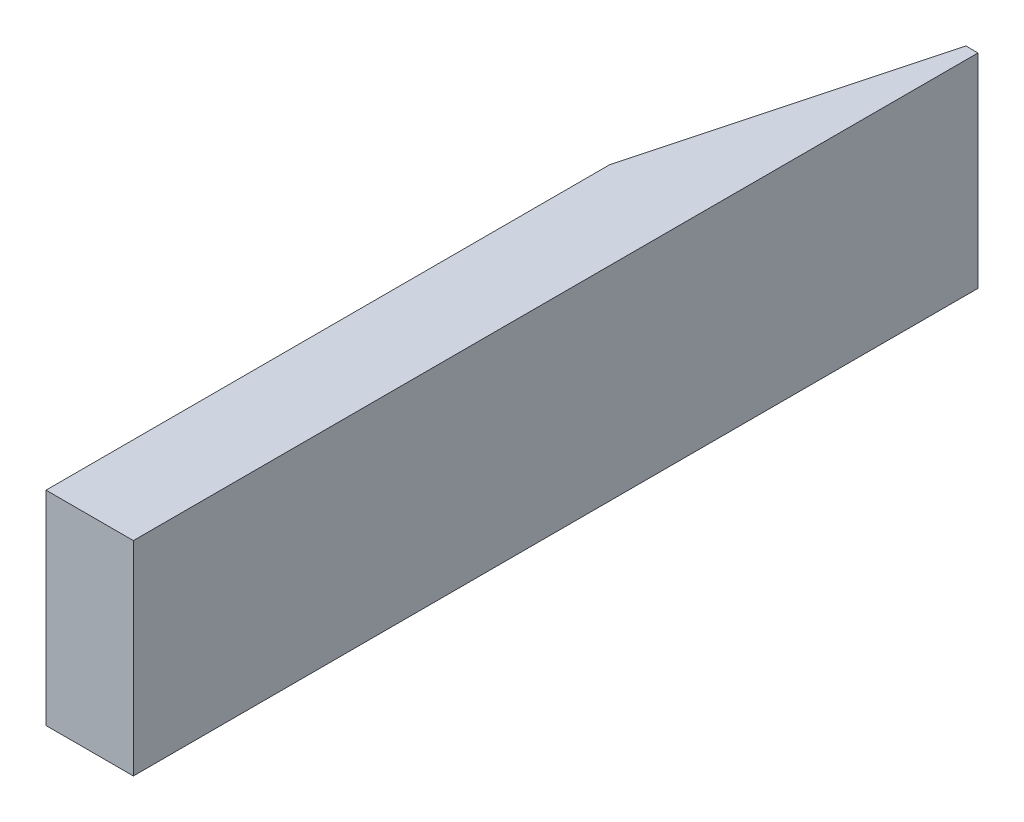
ISO-10303-21;
HEADER;
FILE_DESCRIPTION(('STEP AP214'),'2;1');
FILE_NAME('part.step','',(''),(''),'','','');
FILE_SCHEMA(('AUTOMOTIVE_DESIGN { 1 0 10303 214 1 1 1 1 }'));
ENDSEC;
DATA;
#1=APPLICATION_CONTEXT('core data for automotive mechanical design processes');
#2=APPLICATION_PROTOCOL_DEFINITION('international standard','automotive_design',2000,#1);
#3=PRODUCT_CONTEXT('',#1,'mechanical');
#4=PRODUCT('Part','Part','',(#3));
#5=PRODUCT_RELATED_PRODUCT_CATEGORY('part','',(#4));
#6=PRODUCT_DEFINITION_FORMATION('','',#4);
#7=PRODUCT_DEFINITION_CONTEXT('part definition',#1,'design');
#8=PRODUCT_DEFINITION('design','',#6,#7);
#9=PRODUCT_DEFINITION_SHAPE('','',#8);
#10=(LENGTH_UNIT() NAMED_UNIT(*) SI_UNIT(.MILLI.,.METRE.));
#11=(NAMED_UNIT(*) PLANE_ANGLE_UNIT() SI_UNIT($,.RADIAN.));
#12=(NAMED_UNIT(*) SI_UNIT($,.STERADIAN.) SOLID_ANGLE_UNIT());
#13=UNCERTAINTY_MEASURE_WITH_UNIT(LENGTH_MEASURE(1.E-05),#10,'distance_accuracy_value','');
#14=(GEOMETRIC_REPRESENTATION_CONTEXT(3) GLOBAL_UNCERTAINTY_ASSIGNED_CONTEXT((#13)) GLOBAL_UNIT_ASSIGNED_CONTEXT((#10,
#11,#12)) REPRESENTATION_CONTEXT('',''));
#15=CARTESIAN_POINT('',(0.,0.,0.));
#16=DIRECTION('',(0.,0.,1.));
#17=DIRECTION('',(1.,0.,0.));
#18=AXIS2_PLACEMENT_3D('',#15,#16,#17);
#19=CARTESIAN_POINT('',(0.,0.,368.3));
#20=DIRECTION('',(1.,0.,0.));
#21=DIRECTION('',(0.,1.,0.));
#22=AXIS2_PLACEMENT_3D('',#19,#20,#21);
#23=PLANE('',#22);
#24=DIRECTION('',(0.,0.,-1.));
#25=VECTOR('',#24,1.);
#26=CARTESIAN_POINT('',(0.,88.9,368.3));
#27=LINE('',#26,#25);
#28=CARTESIAN_POINT('',(0.,88.9,368.3));
#29=VERTEX_POINT('',#28);
#30=CARTESIAN_POINT('',(0.,88.9,122.635189536713));
#31=VERTEX_POINT('',#30);
#32=EDGE_CURVE('E108',#29,#31,#27,.T.);
#33=ORIENTED_EDGE('',*,*,#32,.T.);
#34=DIRECTION('',(0.,-1.,0.));
#35=VECTOR('',#34,1.);
#36=CARTESIAN_POINT('',(0.,0.,122.635189536713));
#37=LINE('',#36,#35);
#38=CARTESIAN_POINT('',(0.,0.,122.635189536713));
#39=VERTEX_POINT('',#38);
#40=EDGE_CURVE('E99',#31,#39,#37,.T.);
#41=ORIENTED_EDGE('',*,*,#40,.T.);
#42=DIRECTION('',(0.,0.,-1.));
#43=VECTOR('',#42,1.);
#44=CARTESIAN_POINT('',(0.,0.,368.3));
#45=LINE('',#44,#43);
#46=CARTESIAN_POINT('',(0.,0.,368.3));
#47=VERTEX_POINT('',#46);
#48=EDGE_CURVE('E80',#47,#39,#45,.T.);
#49=ORIENTED_EDGE('',*,*,#48,.F.);
#50=DIRECTION('',(0.,-1.,0.));
#51=VECTOR('',#50,1.);
#52=CARTESIAN_POINT('',(0.,0.,368.3));
#53=LINE('',#52,#51);
#54=EDGE_CURVE('E86',#29,#47,#53,.T.);
#55=ORIENTED_EDGE('',*,*,#54,.F.);
#56=EDGE_LOOP('',(#33,#41,#49,#55));
#57=FACE_BOUND('',#56,.T.);
#58=ADVANCED_FACE('F32',(#57),#23,.F.);
#59=CARTESIAN_POINT('',(0.,0.,368.3));
#60=DIRECTION('',(0.,1.,0.));
#61=DIRECTION('',(0.,0.,1.));
#62=AXIS2_PLACEMENT_3D('',#59,#60,#61);
#63=PLANE('',#62);
#64=ORIENTED_EDGE('',*,*,#48,.T.);
#65=DIRECTION('',(0.258819045102521,0.,-0.965925826289068));
#66=VECTOR('',#65,1.);
#67=CARTESIAN_POINT('',(0.,0.,122.635189536713));
#68=LINE('',#67,#66);
#69=CARTESIAN_POINT('',(32.86,0.,0.));
#70=VERTEX_POINT('',#69);
#71=EDGE_CURVE('E54',#39,#70,#68,.T.);
#72=ORIENTED_EDGE('',*,*,#71,.T.);
#73=DIRECTION('',(1.,0.,0.));
#74=VECTOR('',#73,1.);
#75=CARTESIAN_POINT('',(0.,0.,0.));
#76=LINE('',#75,#74);
#77=CARTESIAN_POINT('',(38.1,0.,0.));
#78=VERTEX_POINT('',#77);
#79=EDGE_CURVE('E113',#70,#78,#76,.T.);
#80=ORIENTED_EDGE('',*,*,#79,.T.);
#81=DIRECTION('',(0.,0.,-1.));
#82=VECTOR('',#81,1.);
#83=CARTESIAN_POINT('',(38.1,0.,368.3));
#84=LINE('',#83,#82);
#85=CARTESIAN_POINT('',(38.1,0.,368.3));
#86=VERTEX_POINT('',#85);
#87=EDGE_CURVE('E82',#86,#78,#84,.T.);
#88=ORIENTED_EDGE('',*,*,#87,.F.);
#89=DIRECTION('',(1.,0.,0.));
#90=VECTOR('',#89,1.);
#91=CARTESIAN_POINT('',(0.,0.,368.3));
#92=LINE('',#91,#90);
#93=EDGE_CURVE('E76',#47,#86,#92,.T.);
#94=ORIENTED_EDGE('',*,*,#93,.F.);
#95=EDGE_LOOP('',(#64,#72,#80,#88,#94));
#96=FACE_BOUND('',#95,.T.);
#97=ADVANCED_FACE('F78',(#96),#63,.F.);
#98=CARTESIAN_POINT('',(38.1,0.,368.3));
#99=DIRECTION('',(-1.,0.,0.));
#100=DIRECTION('',(0.,-1.,0.));
#101=AXIS2_PLACEMENT_3D('',#98,#99,#100);
#102=PLANE('',#101);
#103=DIRECTION('',(0.,1.,0.));
#104=VECTOR('',#103,1.);
#105=CARTESIAN_POINT('',(38.1,0.,0.));
#106=LINE('',#105,#104);
#107=CARTESIAN_POINT('',(38.1,88.9,0.));
#108=VERTEX_POINT('',#107);
#109=EDGE_CURVE('E111',#78,#108,#106,.T.);
#110=ORIENTED_EDGE('',*,*,#109,.T.);
#111=DIRECTION('',(0.,0.,-1.));
#112=VECTOR('',#111,1.);
#113=CARTESIAN_POINT('',(38.1,88.9,368.3));
#114=LINE('',#113,#112);
#115=CARTESIAN_POINT('',(38.1,88.9,368.3));
#116=VERTEX_POINT('',#115);
#117=EDGE_CURVE('E102',#116,#108,#114,.T.);
#118=ORIENTED_EDGE('',*,*,#117,.F.);
#119=DIRECTION('',(0.,1.,0.));
#120=VECTOR('',#119,1.);
#121=CARTESIAN_POINT('',(38.1,0.,368.3));
#122=LINE('',#121,#120);
#123=EDGE_CURVE('E85',#86,#116,#122,.T.);
#124=ORIENTED_EDGE('',*,*,#123,.F.);
#125=ORIENTED_EDGE('',*,*,#87,.T.);
#126=EDGE_LOOP('',(#110,#118,#124,#125));
#127=FACE_BOUND('',#126,.T.);
#128=ADVANCED_FACE('F118',(#127),#102,.F.);
#129=CARTESIAN_POINT('',(0.,88.9,368.3));
#130=DIRECTION('',(0.,-1.,0.));
#131=DIRECTION('',(0.,0.,-1.));
#132=AXIS2_PLACEMENT_3D('',#129,#130,#131);
#133=PLANE('',#132);
#134=DIRECTION('',(-1.,0.,0.));
#135=VECTOR('',#134,1.);
#136=CARTESIAN_POINT('',(0.,88.9,0.));
#137=LINE('',#136,#135);
#138=CARTESIAN_POINT('',(32.86,88.9,0.));
#139=VERTEX_POINT('',#138);
#140=EDGE_CURVE('E95',#108,#139,#137,.T.);
#141=ORIENTED_EDGE('',*,*,#140,.T.);
#142=DIRECTION('',(-0.258819045102521,0.,0.965925826289068));
#143=VECTOR('',#142,1.);
#144=CARTESIAN_POINT('',(0.,88.9,122.635189536713));
#145=LINE('',#144,#143);
#146=EDGE_CURVE('E11',#139,#31,#145,.T.);
#147=ORIENTED_EDGE('',*,*,#146,.T.);
#148=ORIENTED_EDGE('',*,*,#32,.F.);
#149=DIRECTION('',(-1.,0.,0.));
#150=VECTOR('',#149,1.);
#151=CARTESIAN_POINT('',(0.,88.9,368.3));
#152=LINE('',#151,#150);
#153=EDGE_CURVE('E91',#116,#29,#152,.T.);
#154=ORIENTED_EDGE('',*,*,#153,.F.);
#155=ORIENTED_EDGE('',*,*,#117,.T.);
#156=EDGE_LOOP('',(#141,#147,#148,#154,#155));
#157=FACE_BOUND('',#156,.T.);
#158=ADVANCED_FACE('F121',(#157),#133,.F.);
#159=CARTESIAN_POINT('',(0.,0.,368.3));
#160=DIRECTION('',(0.,0.,-1.));
#161=DIRECTION('',(-1.,0.,0.));
#162=AXIS2_PLACEMENT_3D('',#159,#160,#161);
#163=PLANE('',#162);
#164=ORIENTED_EDGE('',*,*,#54,.T.);
#165=ORIENTED_EDGE('',*,*,#93,.T.);
#166=ORIENTED_EDGE('',*,*,#123,.T.);
#167=ORIENTED_EDGE('',*,*,#153,.T.);
#168=EDGE_LOOP('',(#164,#165,#166,#167));
#169=FACE_BOUND('',#168,.T.);
#170=ADVANCED_FACE('F89',(#169),#163,.F.);
#171=CARTESIAN_POINT('',(0.,0.,0.));
#172=DIRECTION('',(0.,0.,-1.));
#173=DIRECTION('',(-1.,0.,0.));
#174=AXIS2_PLACEMENT_3D('',#171,#172,#173);
#175=PLANE('',#174);
#176=ORIENTED_EDGE('',*,*,#79,.F.);
#177=DIRECTION('',(0.,1.,0.));
#178=VECTOR('',#177,1.);
#179=CARTESIAN_POINT('',(32.86,88.9,0.));
#180=LINE('',#179,#178);
#181=EDGE_CURVE('E40',#70,#139,#180,.T.);
#182=ORIENTED_EDGE('',*,*,#181,.T.);
#183=ORIENTED_EDGE('',*,*,#140,.F.);
#184=ORIENTED_EDGE('',*,*,#109,.F.);
#185=EDGE_LOOP('',(#176,#182,#183,#184));
#186=FACE_BOUND('',#185,.T.);
#187=ADVANCED_FACE('F125',(#186),#175,.T.);
#188=CARTESIAN_POINT('',(0.,0.,122.635189536713));
#189=DIRECTION('',(-0.965925826289068,0.,-0.258819045102521));
#190=DIRECTION('',(0.,1.,0.));
#191=AXIS2_PLACEMENT_3D('',#188,#189,#190);
#192=PLANE('',#191);
#193=ORIENTED_EDGE('',*,*,#146,.F.);
#194=ORIENTED_EDGE('',*,*,#181,.F.);
#195=ORIENTED_EDGE('',*,*,#71,.F.);
#196=ORIENTED_EDGE('',*,*,#40,.F.);
#197=EDGE_LOOP('',(#193,#194,#195,#196));
#198=FACE_BOUND('',#197,.T.);
#199=ADVANCED_FACE('F34',(#198),#192,.T.);
#200=CLOSED_SHELL('',(#58,#97,#128,#158,#170,#187,#199));
#201=MANIFOLD_SOLID_BREP('B2',#200);
#202=ADVANCED_BREP_SHAPE_REPRESENTATION('',(#18,#201),#14);
#203=SHAPE_DEFINITION_REPRESENTATION(#9,#202);
ENDSEC;
END-ISO-10303-21;
